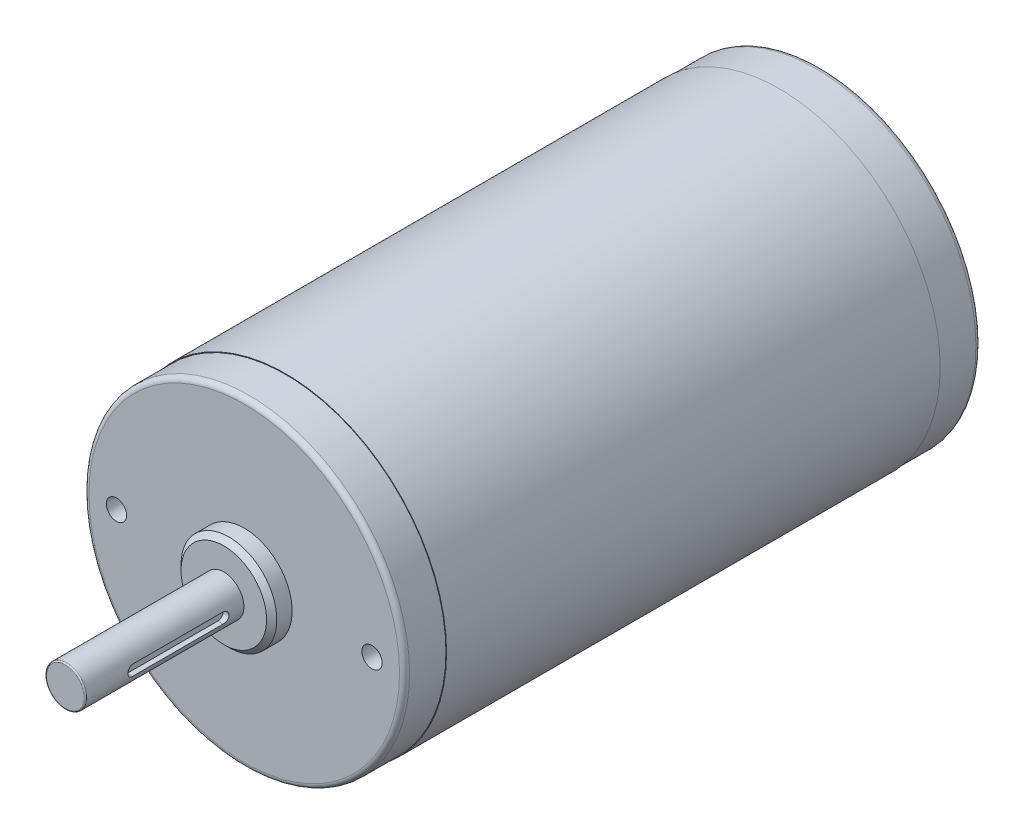
ISO-10303-21;
HEADER;
FILE_DESCRIPTION(('STEP AP214'),'2;1');
FILE_NAME('part.step','',(''),(''),'','','');
FILE_SCHEMA(('AUTOMOTIVE_DESIGN { 1 0 10303 214 1 1 1 1 }'));
ENDSEC;
DATA;
#1=APPLICATION_CONTEXT('core data for automotive mechanical design processes');
#2=APPLICATION_PROTOCOL_DEFINITION('international standard','automotive_design',2000,#1);
#3=PRODUCT_CONTEXT('',#1,'mechanical');
#4=PRODUCT('Part','Part','',(#3));
#5=PRODUCT_RELATED_PRODUCT_CATEGORY('part','',(#4));
#6=PRODUCT_DEFINITION_FORMATION('','',#4);
#7=PRODUCT_DEFINITION_CONTEXT('part definition',#1,'design');
#8=PRODUCT_DEFINITION('design','',#6,#7);
#9=PRODUCT_DEFINITION_SHAPE('','',#8);
#10=(LENGTH_UNIT() NAMED_UNIT(*) SI_UNIT(.MILLI.,.METRE.));
#11=(NAMED_UNIT(*) PLANE_ANGLE_UNIT() SI_UNIT($,.RADIAN.));
#12=(NAMED_UNIT(*) SI_UNIT($,.STERADIAN.) SOLID_ANGLE_UNIT());
#13=UNCERTAINTY_MEASURE_WITH_UNIT(LENGTH_MEASURE(1.E-05),#10,'distance_accuracy_value','');
#14=(GEOMETRIC_REPRESENTATION_CONTEXT(3) GLOBAL_UNCERTAINTY_ASSIGNED_CONTEXT((#13)) GLOBAL_UNIT_ASSIGNED_CONTEXT((#10,
#11,#12)) REPRESENTATION_CONTEXT('',''));
#15=CARTESIAN_POINT('',(0.,0.,0.));
#16=DIRECTION('',(0.,0.,1.));
#17=DIRECTION('',(1.,0.,0.));
#18=AXIS2_PLACEMENT_3D('',#15,#16,#17);
#19=CARTESIAN_POINT('',(35.56,109.2962,54.614));
#20=DIRECTION('',(0.,0.,1.));
#21=DIRECTION('',(1.,0.,0.));
#22=AXIS2_PLACEMENT_3D('',#19,#20,#21);
#23=PLANE('',#22);
#24=CARTESIAN_POINT('',(35.56,109.2962,54.614));
#25=DIRECTION('',(0.,0.,-1.));
#26=DIRECTION('',(-1.,0.,0.));
#27=AXIS2_PLACEMENT_3D('',#24,#25,#26);
#28=CIRCLE('',#27,3.74600000000008);
#29=CARTESIAN_POINT('',(31.8139999999999,109.2962,54.614));
#30=VERTEX_POINT('',#29);
#31=CARTESIAN_POINT('',(39.3060000000001,109.2962,54.614));
#32=VERTEX_POINT('',#31);
#33=EDGE_CURVE('E116',#30,#32,#28,.T.);
#34=ORIENTED_EDGE('',*,*,#33,.F.);
#35=CARTESIAN_POINT('',(35.56,109.2962,54.614));
#36=DIRECTION('',(0.,0.,-1.));
#37=DIRECTION('',(1.,0.,0.));
#38=AXIS2_PLACEMENT_3D('',#35,#36,#37);
#39=CIRCLE('',#38,3.74600000000008);
#40=EDGE_CURVE('E109',#32,#30,#39,.T.);
#41=ORIENTED_EDGE('',*,*,#40,.F.);
#42=EDGE_LOOP('',(#34,#41));
#43=FACE_BOUND('',#42,.T.);
#44=ADVANCED_FACE('F17',(#43),#23,.T.);
#45=CARTESIAN_POINT('',(38.3600000000001,109.2962,16.4984772078548));
#46=DIRECTION('',(1.,0.,0.));
#47=DIRECTION('',(0.,0.,-1.));
#48=AXIS2_PLACEMENT_3D('',#45,#46,#47);
#49=PLANE('',#48);
#50=DIRECTION('',(0.,0.,1.));
#51=VECTOR('',#50,1.);
#52=CARTESIAN_POINT('',(38.3600000000001,108.2462,16.4984772078548));
#53=LINE('',#52,#51);
#54=CARTESIAN_POINT('',(38.3600000000001,108.2462,27.1));
#55=VERTEX_POINT('',#54);
#56=CARTESIAN_POINT('',(38.3600000000001,108.2462,45.1));
#57=VERTEX_POINT('',#56);
#58=EDGE_CURVE('E104',#55,#57,#53,.T.);
#59=ORIENTED_EDGE('',*,*,#58,.F.);
#60=CARTESIAN_POINT('',(38.3600000000001,109.2962,27.1));
#61=DIRECTION('',(1.,0.,0.));
#62=DIRECTION('',(0.,0.,-1.));
#63=AXIS2_PLACEMENT_3D('',#60,#61,#62);
#64=CIRCLE('',#63,1.05);
#65=CARTESIAN_POINT('',(38.3600000000001,110.3462,27.1));
#66=VERTEX_POINT('',#65);
#67=EDGE_CURVE('E94',#55,#66,#64,.T.);
#68=ORIENTED_EDGE('',*,*,#67,.T.);
#69=DIRECTION('',(0.,0.,1.));
#70=VECTOR('',#69,1.);
#71=CARTESIAN_POINT('',(38.3600000000001,110.3462,16.4984772078548));
#72=LINE('',#71,#70);
#73=CARTESIAN_POINT('',(38.3600000000001,110.3462,45.1));
#74=VERTEX_POINT('',#73);
#75=EDGE_CURVE('E120',#66,#74,#72,.T.);
#76=ORIENTED_EDGE('',*,*,#75,.T.);
#77=CARTESIAN_POINT('',(38.3600000000001,109.2962,45.1));
#78=DIRECTION('',(-1.,0.,0.));
#79=DIRECTION('',(0.,0.,1.));
#80=AXIS2_PLACEMENT_3D('',#77,#78,#79);
#81=CIRCLE('',#80,1.05);
#82=EDGE_CURVE('E88',#74,#57,#81,.F.);
#83=ORIENTED_EDGE('',*,*,#82,.T.);
#84=EDGE_LOOP('',(#59,#68,#76,#83));
#85=FACE_BOUND('',#84,.T.);
#86=ADVANCED_FACE('F105',(#85),#49,.T.);
#87=CARTESIAN_POINT('',(38.3600000000001,108.2462,16.4984772078548));
#88=DIRECTION('',(0.,1.,0.));
#89=DIRECTION('',(0.,0.,1.));
#90=AXIS2_PLACEMENT_3D('',#87,#88,#89);
#91=PLANE('',#90);
#92=DIRECTION('',(0.,0.,-1.));
#93=VECTOR('',#92,1.);
#94=CARTESIAN_POINT('',(39.4197279696891,108.2462,54.614));
#95=LINE('',#94,#93);
#96=CARTESIAN_POINT('',(39.4197279696891,108.2462,27.1));
#97=VERTEX_POINT('',#96);
#98=CARTESIAN_POINT('',(39.4197279696891,108.2462,45.1));
#99=VERTEX_POINT('',#98);
#100=EDGE_CURVE('E113',#97,#99,#95,.F.);
#101=ORIENTED_EDGE('',*,*,#100,.F.);
#102=DIRECTION('',(1.,0.,0.));
#103=VECTOR('',#102,1.);
#104=CARTESIAN_POINT('',(38.3600000000001,108.2462,27.1));
#105=LINE('',#104,#103);
#106=EDGE_CURVE('E98',#97,#55,#105,.F.);
#107=ORIENTED_EDGE('',*,*,#106,.T.);
#108=ORIENTED_EDGE('',*,*,#58,.T.);
#109=DIRECTION('',(1.,0.,0.));
#110=VECTOR('',#109,1.);
#111=CARTESIAN_POINT('',(38.3600000000001,108.2462,45.1));
#112=LINE('',#111,#110);
#113=EDGE_CURVE('E114',#57,#99,#112,.T.);
#114=ORIENTED_EDGE('',*,*,#113,.T.);
#115=EDGE_LOOP('',(#101,#107,#108,#114));
#116=FACE_BOUND('',#115,.T.);
#117=ADVANCED_FACE('F111',(#116),#91,.T.);
#118=CARTESIAN_POINT('',(35.56,109.2962,54.36));
#119=DIRECTION('',(0.,0.,1.));
#120=DIRECTION('',(1.,0.,0.));
#121=AXIS2_PLACEMENT_3D('',#118,#119,#120);
#122=TOROIDAL_SURFACE('',#121,3.74600000000008,0.254);
#123=ORIENTED_EDGE('',*,*,#40,.T.);
#124=ORIENTED_EDGE('',*,*,#33,.T.);
#125=EDGE_LOOP('',(#123,#124));
#126=FACE_BOUND('',#125,.T.);
#127=CARTESIAN_POINT('',(35.56,109.2962,54.36));
#128=DIRECTION('',(0.,0.,-1.));
#129=DIRECTION('',(-1.,0.,0.));
#130=AXIS2_PLACEMENT_3D('',#127,#128,#129);
#131=CIRCLE('',#130,4.00000000000007);
#132=CARTESIAN_POINT('',(31.5599999999999,109.2962,54.36));
#133=VERTEX_POINT('',#132);
#134=EDGE_CURVE('E165',#133,#133,#131,.T.);
#135=ORIENTED_EDGE('',*,*,#134,.F.);
#136=EDGE_LOOP('',(#135));
#137=FACE_BOUND('',#136,.T.);
#138=ADVANCED_FACE('F147',(#126,#137),#122,.T.);
#139=CARTESIAN_POINT('',(38.3600000000001,109.2962,45.1));
#140=DIRECTION('',(-1.,0.,0.));
#141=DIRECTION('',(0.,0.,1.));
#142=AXIS2_PLACEMENT_3D('',#139,#140,#141);
#143=CYLINDRICAL_SURFACE('',#142,1.05);
#144=DIRECTION('',(1.,0.,0.));
#145=VECTOR('',#144,1.);
#146=CARTESIAN_POINT('',(38.3600000000001,110.3462,45.1));
#147=LINE('',#146,#145);
#148=CARTESIAN_POINT('',(39.4197279696891,110.3462,45.1));
#149=VERTEX_POINT('',#148);
#150=EDGE_CURVE('E102',#74,#149,#147,.T.);
#151=ORIENTED_EDGE('',*,*,#150,.T.);
#152=CARTESIAN_POINT('',(39.4197279696891,108.2462,45.1));
#153=CARTESIAN_POINT('',(39.4197258950768,108.24619958975,45.1289948990377));
#154=CARTESIAN_POINT('',(39.4200551064328,108.247401772744,45.1579753771942));
#155=CARTESIAN_POINT('',(39.4213547123988,108.252193790165,45.2157185717611));
#156=CARTESIAN_POINT('',(39.4223249908093,108.255783191888,45.2444813266804));
#157=CARTESIAN_POINT('',(39.4261578920524,108.270078067236,45.3300048839447));
#158=CARTESIAN_POINT('',(39.4299428342912,108.284310457697,45.3861763507014));
#159=CARTESIAN_POINT('',(39.4395286889104,108.321713164946,45.4952257963179));
#160=CARTESIAN_POINT('',(39.445329326456,108.344882263286,45.5481042230163));
#161=CARTESIAN_POINT('',(39.4582892232805,108.399469503916,45.6492511443793));
#162=CARTESIAN_POINT('',(39.4654488628844,108.430889956344,45.6975183428654));
#163=CARTESIAN_POINT('',(39.4805119710478,108.501890363002,45.7892077701155));
#164=CARTESIAN_POINT('',(39.4884281885094,108.541632256913,45.8325024671448));
#165=CARTESIAN_POINT('',(39.5040047400555,108.627813145963,45.9119068745175));
#166=CARTESIAN_POINT('',(39.5116649818293,108.67425452566,45.9480140156475));
#167=CARTESIAN_POINT('',(39.526010604883,108.773412379805,46.0125503896214));
#168=CARTESIAN_POINT('',(39.5326785635433,108.826216831296,46.040848518688));
#169=CARTESIAN_POINT('',(39.5441298010583,108.936002054238,46.0880888400132));
#170=CARTESIAN_POINT('',(39.5489153447307,108.992977708579,46.1070422822868));
#171=CARTESIAN_POINT('',(39.5549473168842,109.091228422711,46.1306241727345));
#172=CARTESIAN_POINT('',(39.5568321627736,109.13185376544,46.1378772746766));
#173=CARTESIAN_POINT('',(39.5593590428507,109.213713896391,46.147566034752));
#174=CARTESIAN_POINT('',(39.560001100914,109.254948672889,46.1500017854335));
#175=CARTESIAN_POINT('',(39.5599984549201,109.354094261643,46.1499974942296));
#176=CARTESIAN_POINT('',(39.5587300938834,109.412021122661,46.1451938276971));
#177=CARTESIAN_POINT('',(39.5537908073877,109.526225171743,46.1261319193829));
#178=CARTESIAN_POINT('',(39.5501176251492,109.582500758305,46.1118647965529));
#179=CARTESIAN_POINT('',(39.5407752151886,109.691711041936,46.0743710095572));
#180=CARTESIAN_POINT('',(39.5351088856793,109.744650458997,46.051157349786));
#181=CARTESIAN_POINT('',(39.5223803452478,109.845880148194,45.9964722913931));
#182=CARTESIAN_POINT('',(39.5153181479083,109.894170465564,45.9650009731229));
#183=CARTESIAN_POINT('',(39.5003832391547,109.985824414736,45.8939447079381));
#184=CARTESIAN_POINT('',(39.4924970081334,110.029068444468,45.8542083308329));
#185=CARTESIAN_POINT('',(39.4768899553604,110.108363690847,45.768070017791));
#186=CARTESIAN_POINT('',(39.4691691622905,110.144413669136,45.7216669366335));
#187=CARTESIAN_POINT('',(39.4546281048764,110.208880604601,45.6225587145474));
#188=CARTESIAN_POINT('',(39.447825217303,110.237158627992,45.5697605148942));
#189=CARTESIAN_POINT('',(39.4360941322255,110.284374941225,45.4599645484902));
#190=CARTESIAN_POINT('',(39.4311644713835,110.303320524877,45.4029701015121));
#191=CARTESIAN_POINT('',(39.424947536189,110.326869937927,45.3047298343336));
#192=CARTESIAN_POINT('',(39.4230031721686,110.334106552333,45.2641375466187));
#193=CARTESIAN_POINT('',(39.4203876966156,110.343775049367,45.1823710409093));
#194=CARTESIAN_POINT('',(39.419715789786,110.346209933161,45.141197202614));
#195=CARTESIAN_POINT('',(39.4197279696891,110.3462,45.1));
#196=B_SPLINE_CURVE_WITH_KNOTS('',3,(#152,#153,#154,#155,#156,#157,#158,#159,#160,#161,#162,
#163,#164,#165,#166,#167,#168,#169,#170,#171,#172,#173,#174,#175,#176,#177,#178,#179,#180,#181,
#182,#183,#184,#185,#186,#187,#188,#189,#190,#191,#192,#193,#194,#195),.UNSPECIFIED.,.F.,.F.,(4,
2,2,2,2,2,2,2,2,2,2,2,2,2,2,2,2,2,2,2,2,4),(0.,0.0869295778834422,0.17384340328612,
0.347151826879625,0.520436629596116,0.69376999881019,0.870856390838584,1.04800596970821,
1.22797015523126,1.40771715061754,1.53136439682193,1.65500926755904,1.82853892099362,
2.0022316554156,2.17567286221397,2.34911238140169,2.52606492372393,2.70304789975981,
2.88301467869373,3.0628405797152,3.18638852057382,3.3098592173462),.UNSPECIFIED.);
#197=EDGE_CURVE('E168',#99,#149,#196,.T.);
#198=ORIENTED_EDGE('',*,*,#197,.F.);
#199=ORIENTED_EDGE('',*,*,#113,.F.);
#200=ORIENTED_EDGE('',*,*,#82,.F.);
#201=EDGE_LOOP('',(#151,#198,#199,#200));
#202=FACE_BOUND('',#201,.T.);
#203=ADVANCED_FACE('F157',(#202),#143,.F.);
#204=CARTESIAN_POINT('',(38.3600000000001,110.3462,16.4984772078548));
#205=DIRECTION('',(0.,1.,0.));
#206=DIRECTION('',(0.,0.,1.));
#207=AXIS2_PLACEMENT_3D('',#204,#205,#206);
#208=PLANE('',#207);
#209=ORIENTED_EDGE('',*,*,#150,.F.);
#210=ORIENTED_EDGE('',*,*,#75,.F.);
#211=DIRECTION('',(1.,0.,0.));
#212=VECTOR('',#211,1.);
#213=CARTESIAN_POINT('',(38.3600000000001,110.3462,27.1));
#214=LINE('',#213,#212);
#215=CARTESIAN_POINT('',(39.4197279696891,110.3462,27.1));
#216=VERTEX_POINT('',#215);
#217=EDGE_CURVE('E100',#66,#216,#214,.T.);
#218=ORIENTED_EDGE('',*,*,#217,.T.);
#219=DIRECTION('',(0.,0.,-1.));
#220=VECTOR('',#219,1.);
#221=CARTESIAN_POINT('',(39.4197279696891,110.3462,54.614));
#222=LINE('',#221,#220);
#223=EDGE_CURVE('E170',#149,#216,#222,.T.);
#224=ORIENTED_EDGE('',*,*,#223,.F.);
#225=EDGE_LOOP('',(#209,#210,#218,#224));
#226=FACE_BOUND('',#225,.T.);
#227=ADVANCED_FACE('F416',(#226),#208,.F.);
#228=CARTESIAN_POINT('',(38.3600000000001,109.2962,27.1));
#229=DIRECTION('',(1.,0.,0.));
#230=DIRECTION('',(0.,0.,-1.));
#231=AXIS2_PLACEMENT_3D('',#228,#229,#230);
#232=CYLINDRICAL_SURFACE('',#231,1.05);
#233=ORIENTED_EDGE('',*,*,#67,.F.);
#234=ORIENTED_EDGE('',*,*,#106,.F.);
#235=CARTESIAN_POINT('',(39.4197279696891,110.3462,27.1));
#236=CARTESIAN_POINT('',(39.4197258950768,110.34620041025,27.0710051009623));
#237=CARTESIAN_POINT('',(39.4200551064329,110.344998227256,27.0420246228058));
#238=CARTESIAN_POINT('',(39.4213547123988,110.340206209835,26.9842814282389));
#239=CARTESIAN_POINT('',(39.4223249908093,110.336616808112,26.9555186733196));
#240=CARTESIAN_POINT('',(39.4261578920524,110.322321932764,26.8699951160553));
#241=CARTESIAN_POINT('',(39.4299428342912,110.308089542303,26.8138236492985));
#242=CARTESIAN_POINT('',(39.4395286889104,110.270686835054,26.7047742036821));
#243=CARTESIAN_POINT('',(39.445329326456,110.247517736714,26.6518957769836));
#244=CARTESIAN_POINT('',(39.4582892232805,110.192930496084,26.5507488556207));
#245=CARTESIAN_POINT('',(39.4654488628844,110.161510043656,26.5024816571346));
#246=CARTESIAN_POINT('',(39.4805119710478,110.090509636998,26.4107922298844));
#247=CARTESIAN_POINT('',(39.4884281885094,110.050767743087,26.3674975328551));
#248=CARTESIAN_POINT('',(39.5040047400555,109.964586854037,26.2880931254825));
#249=CARTESIAN_POINT('',(39.5116649818293,109.91814547434,26.2519859843525));
#250=CARTESIAN_POINT('',(39.526010604883,109.818987620195,26.1874496103786));
#251=CARTESIAN_POINT('',(39.5326785635433,109.766183168704,26.159151481312));
#252=CARTESIAN_POINT('',(39.5441298010583,109.656397945762,26.1119111599868));
#253=CARTESIAN_POINT('',(39.5489153447307,109.599422291421,26.0929577177131));
#254=CARTESIAN_POINT('',(39.5549473168842,109.501171577289,26.0693758272655));
#255=CARTESIAN_POINT('',(39.5568321627736,109.46054623456,26.0621227253234));
#256=CARTESIAN_POINT('',(39.5593590428507,109.378686103609,26.052433965248));
#257=CARTESIAN_POINT('',(39.560001100914,109.337451327111,26.0499982145665));
#258=CARTESIAN_POINT('',(39.5599984549201,109.238305738357,26.0500025057704));
#259=CARTESIAN_POINT('',(39.5587300938834,109.18037887734,26.0548061723029));
#260=CARTESIAN_POINT('',(39.5537908073877,109.066174828257,26.0738680806171));
#261=CARTESIAN_POINT('',(39.5501176251492,109.009899241695,26.0881352034471));
#262=CARTESIAN_POINT('',(39.5407752151886,108.900688958064,26.1256289904428));
#263=CARTESIAN_POINT('',(39.5351088856793,108.847749541003,26.148842650214));
#264=CARTESIAN_POINT('',(39.5223803452478,108.746519851806,26.2035277086069));
#265=CARTESIAN_POINT('',(39.5153181479083,108.698229534436,26.2349990268771));
#266=CARTESIAN_POINT('',(39.5003832391547,108.606575585264,26.3060552920619));
#267=CARTESIAN_POINT('',(39.4924970081334,108.563331555532,26.3457916691671));
#268=CARTESIAN_POINT('',(39.4768899553604,108.484036309153,26.431929982209));
#269=CARTESIAN_POINT('',(39.4691691622905,108.447986330864,26.4783330633665));
#270=CARTESIAN_POINT('',(39.4546281048764,108.383519395399,26.5774412854526));
#271=CARTESIAN_POINT('',(39.447825217303,108.355241372008,26.6302394851058));
#272=CARTESIAN_POINT('',(39.4360941322255,108.308025058775,26.7400354515098));
#273=CARTESIAN_POINT('',(39.4311644713835,108.289079475123,26.7970298984879));
#274=CARTESIAN_POINT('',(39.424947536189,108.265530062073,26.8952701656664));
#275=CARTESIAN_POINT('',(39.4230031721686,108.258293447667,26.9358624533813));
#276=CARTESIAN_POINT('',(39.4203876966156,108.248624950633,27.0176289590907));
#277=CARTESIAN_POINT('',(39.419715789786,108.246190066839,27.058802797386));
#278=CARTESIAN_POINT('',(39.4197279696891,108.2462,27.1));
#279=B_SPLINE_CURVE_WITH_KNOTS('',3,(#235,#236,#237,#238,#239,#240,#241,#242,#243,#244,#245,
#246,#247,#248,#249,#250,#251,#252,#253,#254,#255,#256,#257,#258,#259,#260,#261,#262,#263,#264,
#265,#266,#267,#268,#269,#270,#271,#272,#273,#274,#275,#276,#277,#278),.UNSPECIFIED.,.F.,.F.,(4,
2,2,2,2,2,2,2,2,2,2,2,2,2,2,2,2,2,2,2,2,4),(0.,0.0869295778834455,0.173843403286115,
0.347151826879623,0.520436629596136,0.693769998810197,0.870856390838592,1.0480059697082,
1.22797015523124,1.40771715061754,1.53136439682191,1.65500926755904,1.82853892099358,
2.00223165541559,2.17567286221396,2.34911238140168,2.52606492372391,2.7030478997598,
2.88301467869372,3.06284057971519,3.18638852057381,3.30985921734618),.UNSPECIFIED.);
#280=EDGE_CURVE('E173',#216,#97,#279,.T.);
#281=ORIENTED_EDGE('',*,*,#280,.F.);
#282=ORIENTED_EDGE('',*,*,#217,.F.);
#283=EDGE_LOOP('',(#233,#234,#281,#282));
#284=FACE_BOUND('',#283,.T.);
#285=ADVANCED_FACE('F95',(#284),#232,.F.);
#286=CARTESIAN_POINT('',(35.56,109.2962,54.614));
#287=DIRECTION('',(0.,0.,-1.));
#288=DIRECTION('',(-1.,0.,0.));
#289=AXIS2_PLACEMENT_3D('',#286,#287,#288);
#290=CYLINDRICAL_SURFACE('',#289,4.00000000000007);
#291=ORIENTED_EDGE('',*,*,#100,.T.);
#292=ORIENTED_EDGE('',*,*,#197,.T.);
#293=ORIENTED_EDGE('',*,*,#223,.T.);
#294=ORIENTED_EDGE('',*,*,#280,.T.);
#295=EDGE_LOOP('',(#291,#292,#293,#294));
#296=FACE_BOUND('',#295,.T.);
#297=CARTESIAN_POINT('',(35.56,109.2962,23.114));
#298=DIRECTION('',(0.,0.,-1.));
#299=DIRECTION('',(-1.,0.,0.));
#300=AXIS2_PLACEMENT_3D('',#297,#298,#299);
#301=CIRCLE('',#300,4.00000000000007);
#302=CARTESIAN_POINT('',(31.5599999999999,109.2962,23.114));
#303=VERTEX_POINT('',#302);
#304=EDGE_CURVE('E409',#303,#303,#301,.T.);
#305=ORIENTED_EDGE('',*,*,#304,.F.);
#306=EDGE_LOOP('',(#305));
#307=FACE_BOUND('',#306,.T.);
#308=ORIENTED_EDGE('',*,*,#134,.T.);
#309=EDGE_LOOP('',(#308));
#310=FACE_BOUND('',#309,.T.);
#311=ADVANCED_FACE('F256',(#296,#307,#310),#290,.T.);
#312=CARTESIAN_POINT('',(35.56,109.2962,23.114));
#313=DIRECTION('',(0.,0.,1.));
#314=DIRECTION('',(1.,0.,0.));
#315=AXIS2_PLACEMENT_3D('',#312,#313,#314);
#316=PLANE('',#315);
#317=ORIENTED_EDGE('',*,*,#304,.T.);
#318=EDGE_LOOP('',(#317));
#319=FACE_BOUND('',#318,.T.);
#320=CARTESIAN_POINT('',(35.56,109.2962,23.114));
#321=DIRECTION('',(0.,0.,-1.));
#322=DIRECTION('',(-1.,0.,0.));
#323=AXIS2_PLACEMENT_3D('',#320,#321,#322);
#324=CIRCLE('',#323,8.50900000182337);
#325=CARTESIAN_POINT('',(27.0509999981766,109.2962,23.114));
#326=VERTEX_POINT('',#325);
#327=EDGE_CURVE('E407',#326,#326,#324,.T.);
#328=ORIENTED_EDGE('',*,*,#327,.F.);
#329=EDGE_LOOP('',(#328));
#330=FACE_BOUND('',#329,.T.);
#331=ADVANCED_FACE('F252',(#319,#330),#316,.T.);
#332=CARTESIAN_POINT('',(48.8853596371201,127.903290682857,-97.8026999980236));
#333=DIRECTION('',(0.,0.,-1.));
#334=DIRECTION('',(-1.,0.,0.));
#335=AXIS2_PLACEMENT_3D('',#332,#333,#334);
#336=PLANE('',#335);
#337=CARTESIAN_POINT('',(46.76735963712,127.903290682857,-97.8026999979988));
#338=DIRECTION('',(0.,0.,1.));
#339=DIRECTION('',(0.,-1.,0.));
#340=AXIS2_PLACEMENT_3D('',#337,#338,#339);
#341=CIRCLE('',#340,2.11800000003411);
#342=CARTESIAN_POINT('',(46.76735963712,125.785290682823,-97.8026999979988));
#343=VERTEX_POINT('',#342);
#344=EDGE_CURVE('E404',#343,#343,#341,.T.);
#345=ORIENTED_EDGE('',*,*,#344,.F.);
#346=EDGE_LOOP('',(#345));
#347=FACE_BOUND('',#346,.T.);
#348=ADVANCED_FACE('F248',(#347),#336,.T.);
#349=CARTESIAN_POINT('',(56.2850906808811,120.503559639096,-97.8026999980238));
#350=DIRECTION('',(0.,0.,-1.));
#351=DIRECTION('',(-1.,0.,0.));
#352=AXIS2_PLACEMENT_3D('',#349,#350,#351);
#353=PLANE('',#352);
#354=CARTESIAN_POINT('',(54.1670906808811,120.503559639096,-97.8026999980557));
#355=DIRECTION('',(0.,0.,1.));
#356=DIRECTION('',(0.,-1.,0.));
#357=AXIS2_PLACEMENT_3D('',#354,#355,#356);
#358=CIRCLE('',#357,2.11799999994966);
#359=CARTESIAN_POINT('',(54.1670906808811,118.385559639146,-97.8026999980557));
#360=VERTEX_POINT('',#359);
#361=EDGE_CURVE('E400',#360,#360,#358,.T.);
#362=ORIENTED_EDGE('',*,*,#361,.F.);
#363=EDGE_LOOP('',(#362));
#364=FACE_BOUND('',#363,.T.);
#365=ADVANCED_FACE('F236',(#364),#353,.T.);
#366=CARTESIAN_POINT('',(35.56,109.2962,-100.317299999998));
#367=DIRECTION('',(0.,0.,-1.));
#368=DIRECTION('',(-1.,0.,0.));
#369=AXIS2_PLACEMENT_3D('',#366,#367,#368);
#370=PLANE('',#369);
#371=CARTESIAN_POINT('',(35.56,109.2962,-100.317299999998));
#372=DIRECTION('',(0.,0.,1.));
#373=DIRECTION('',(1.,0.,0.));
#374=AXIS2_PLACEMENT_3D('',#371,#372,#373);
#375=CIRCLE('',#374,14.0368000000003);
#376=CARTESIAN_POINT('',(49.5968000000003,109.2962,-100.317299999998));
#377=VERTEX_POINT('',#376);
#378=CARTESIAN_POINT('',(21.5231999999997,109.2962,-100.317299999998));
#379=VERTEX_POINT('',#378);
#380=EDGE_CURVE('E217',#377,#379,#375,.T.);
#381=ORIENTED_EDGE('',*,*,#380,.F.);
#382=CARTESIAN_POINT('',(35.56,109.2962,-100.317299999998));
#383=DIRECTION('',(0.,0.,1.));
#384=DIRECTION('',(-1.,0.,0.));
#385=AXIS2_PLACEMENT_3D('',#382,#383,#384);
#386=CIRCLE('',#385,14.0368000000003);
#387=EDGE_CURVE('E403',#379,#377,#386,.T.);
#388=ORIENTED_EDGE('',*,*,#387,.F.);
#389=EDGE_LOOP('',(#381,#388));
#390=FACE_BOUND('',#389,.T.);
#391=ADVANCED_FACE('F225',(#390),#370,.T.);
#392=CARTESIAN_POINT('',(10.1599999999994,109.2962,5.43560000011212));
#393=DIRECTION('',(0.,0.,1.));
#394=DIRECTION('',(1.,0.,0.));
#395=AXIS2_PLACEMENT_3D('',#392,#393,#394);
#396=CONICAL_SURFACE('',#395,2.01930000012817,1.02974425747654);
#397=CARTESIAN_POINT('',(10.1600000000133,109.2962,4.22228214875986));
#398=VERTEX_POINT('',#397);
#399=VERTEX_LOOP('',#398);
#400=FACE_BOUND('',#399,.T.);
#401=CARTESIAN_POINT('',(10.1599999999994,109.2962,5.4356000000007));
#402=DIRECTION('',(0.,0.,1.));
#403=DIRECTION('',(1.,0.,0.));
#404=AXIS2_PLACEMENT_3D('',#401,#402,#403);
#405=CIRCLE('',#404,2.01930000000003);
#406=CARTESIAN_POINT('',(12.1792999999994,109.2962,5.4356000000007));
#407=VERTEX_POINT('',#406);
#408=EDGE_CURVE('E214',#407,#407,#405,.T.);
#409=ORIENTED_EDGE('',*,*,#408,.T.);
#410=EDGE_LOOP('',(#409));
#411=FACE_BOUND('',#410,.T.);
#412=ADVANCED_FACE('F235',(#400,#411),#396,.F.);
#413=CARTESIAN_POINT('',(60.96,109.2962,5.43559999994159));
#414=DIRECTION('',(0.,0.,1.));
#415=DIRECTION('',(1.,0.,0.));
#416=AXIS2_PLACEMENT_3D('',#413,#414,#415);
#417=CONICAL_SURFACE('',#416,2.01929999988128,1.02974425744088);
#418=CARTESIAN_POINT('',(60.9599999998807,109.2962,4.22228214875986));
#419=VERTEX_POINT('',#418);
#420=VERTEX_LOOP('',#419);
#421=FACE_BOUND('',#420,.T.);
#422=CARTESIAN_POINT('',(60.96,109.2962,5.43560000000074));
#423=DIRECTION('',(0.,0.,1.));
#424=DIRECTION('',(1.,0.,0.));
#425=AXIS2_PLACEMENT_3D('',#422,#423,#424);
#426=CIRCLE('',#425,2.01930000000003);
#427=CARTESIAN_POINT('',(62.9793,109.2962,5.43560000000074));
#428=VERTEX_POINT('',#427);
#429=EDGE_CURVE('E211',#428,#428,#426,.T.);
#430=ORIENTED_EDGE('',*,*,#429,.T.);
#431=EDGE_LOOP('',(#430));
#432=FACE_BOUND('',#431,.T.);
#433=ADVANCED_FACE('F572',(#421,#432),#417,.F.);
#434=CARTESIAN_POINT('',(35.56,109.2962,22.0979999999996));
#435=DIRECTION('',(0.,0.,-1.));
#436=DIRECTION('',(-1.,0.,0.));
#437=AXIS2_PLACEMENT_3D('',#434,#435,#436);
#438=CONICAL_SURFACE('',#437,9.52500000000019,0.785398162500005);
#439=CARTESIAN_POINT('',(35.56,109.2962,22.0979999999996));
#440=DIRECTION('',(0.,0.,-1.));
#441=DIRECTION('',(-1.,0.,0.));
#442=AXIS2_PLACEMENT_3D('',#439,#440,#441);
#443=CIRCLE('',#442,9.52500000000019);
#444=CARTESIAN_POINT('',(26.0349999999998,109.2962,22.0979999999996));
#445=VERTEX_POINT('',#444);
#446=EDGE_CURVE('E208',#445,#445,#443,.T.);
#447=ORIENTED_EDGE('',*,*,#446,.F.);
#448=EDGE_LOOP('',(#447));
#449=FACE_BOUND('',#448,.T.);
#450=ORIENTED_EDGE('',*,*,#327,.T.);
#451=EDGE_LOOP('',(#450));
#452=FACE_BOUND('',#451,.T.);
#453=ADVANCED_FACE('F565',(#449,#452),#438,.T.);
#454=CARTESIAN_POINT('',(46.76735963712,127.903290682857,-95.6026999959931));
#455=DIRECTION('',(0.,0.,1.));
#456=DIRECTION('',(0.,-1.,0.));
#457=AXIS2_PLACEMENT_3D('',#454,#455,#456);
#458=CONICAL_SURFACE('',#457,4.31800000198298,0.785398163384529);
#459=CARTESIAN_POINT('',(46.76735963712,127.903290682857,-95.6026999960491));
#460=DIRECTION('',(0.,0.,1.));
#461=DIRECTION('',(1.,0.,0.));
#462=AXIS2_PLACEMENT_3D('',#459,#460,#461);
#463=CIRCLE('',#462,4.3180000019745);
#464=CARTESIAN_POINT('',(51.0853596390945,127.903290682857,-95.6026999960491));
#465=VERTEX_POINT('',#464);
#466=EDGE_CURVE('E205',#465,#465,#463,.T.);
#467=ORIENTED_EDGE('',*,*,#466,.F.);
#468=EDGE_LOOP('',(#467));
#469=FACE_BOUND('',#468,.T.);
#470=ORIENTED_EDGE('',*,*,#344,.T.);
#471=EDGE_LOOP('',(#470));
#472=FACE_BOUND('',#471,.T.);
#473=ADVANCED_FACE('F571',(#469,#472),#458,.T.);
#474=CARTESIAN_POINT('',(54.1670906808811,120.503559639096,-95.6026999961637));
#475=DIRECTION('',(0.,0.,1.));
#476=DIRECTION('',(0.,-1.,0.));
#477=AXIS2_PLACEMENT_3D('',#474,#475,#476);
#478=CONICAL_SURFACE('',#477,4.31800000184168,0.785398163397448);
#479=CARTESIAN_POINT('',(54.1670906808811,120.503559639096,-95.6026999960494));
#480=DIRECTION('',(0.,0.,1.));
#481=DIRECTION('',(1.,0.,0.));
#482=AXIS2_PLACEMENT_3D('',#479,#480,#481);
#483=CIRCLE('',#482,4.31800000197446);
#484=CARTESIAN_POINT('',(58.4850906828556,120.503559639096,-95.6026999960494));
#485=VERTEX_POINT('',#484);
#486=EDGE_CURVE('E202',#485,#485,#483,.T.);
#487=ORIENTED_EDGE('',*,*,#486,.F.);
#488=EDGE_LOOP('',(#487));
#489=FACE_BOUND('',#488,.T.);
#490=ORIENTED_EDGE('',*,*,#361,.T.);
#491=EDGE_LOOP('',(#490));
#492=FACE_BOUND('',#491,.T.);
#493=ADVANCED_FACE('F192',(#489,#492),#478,.T.);
#494=CARTESIAN_POINT('',(35.56,109.2962,-99.317299999998));
#495=DIRECTION('',(0.,0.,-1.));
#496=DIRECTION('',(-1.,0.,0.));
#497=AXIS2_PLACEMENT_3D('',#494,#495,#496);
#498=TOROIDAL_SURFACE('',#497,14.0368000000003,1.);
#499=ORIENTED_EDGE('',*,*,#387,.T.);
#500=ORIENTED_EDGE('',*,*,#380,.T.);
#501=EDGE_LOOP('',(#499,#500));
#502=FACE_BOUND('',#501,.T.);
#503=CARTESIAN_POINT('',(35.56,109.2962,-99.317299999998));
#504=DIRECTION('',(0.,0.,1.));
#505=DIRECTION('',(1.,0.,0.));
#506=AXIS2_PLACEMENT_3D('',#503,#504,#505);
#507=CIRCLE('',#506,15.0368000000003);
#508=CARTESIAN_POINT('',(50.5968000000003,109.2962,-99.317299999998));
#509=VERTEX_POINT('',#508);
#510=EDGE_CURVE('E200',#509,#509,#507,.T.);
#511=ORIENTED_EDGE('',*,*,#510,.F.);
#512=EDGE_LOOP('',(#511));
#513=FACE_BOUND('',#512,.T.);
#514=ADVANCED_FACE('F180',(#502,#513),#498,.T.);
#515=CARTESIAN_POINT('',(10.1599999999994,109.2962,19.05));
#516=DIRECTION('',(0.,0.,1.));
#517=DIRECTION('',(1.,0.,0.));
#518=AXIS2_PLACEMENT_3D('',#515,#516,#517);
#519=CYLINDRICAL_SURFACE('',#518,2.01930000000003);
#520=CARTESIAN_POINT('',(10.1599999999994,109.2962,19.05));
#521=DIRECTION('',(0.,0.,1.));
#522=DIRECTION('',(1.,0.,0.));
#523=AXIS2_PLACEMENT_3D('',#520,#521,#522);
#524=CIRCLE('',#523,2.01930000000003);
#525=CARTESIAN_POINT('',(12.1792999999994,109.2962,19.05));
#526=VERTEX_POINT('',#525);
#527=EDGE_CURVE('E397',#526,#526,#524,.F.);
#528=ORIENTED_EDGE('',*,*,#527,.F.);
#529=EDGE_LOOP('',(#528));
#530=FACE_BOUND('',#529,.T.);
#531=ORIENTED_EDGE('',*,*,#408,.F.);
#532=EDGE_LOOP('',(#531));
#533=FACE_BOUND('',#532,.T.);
#534=ADVANCED_FACE('F191',(#530,#533),#519,.F.);
#535=CARTESIAN_POINT('',(60.96,109.2962,19.05));
#536=DIRECTION('',(0.,0.,1.));
#537=DIRECTION('',(1.,0.,0.));
#538=AXIS2_PLACEMENT_3D('',#535,#536,#537);
#539=CYLINDRICAL_SURFACE('',#538,2.01930000000003);
#540=CARTESIAN_POINT('',(60.96,109.2962,19.05));
#541=DIRECTION('',(0.,0.,1.));
#542=DIRECTION('',(1.,0.,0.));
#543=AXIS2_PLACEMENT_3D('',#540,#541,#542);
#544=CIRCLE('',#543,2.01930000000003);
#545=CARTESIAN_POINT('',(62.9793,109.2962,19.05));
#546=VERTEX_POINT('',#545);
#547=EDGE_CURVE('E394',#546,#546,#544,.F.);
#548=ORIENTED_EDGE('',*,*,#547,.F.);
#549=EDGE_LOOP('',(#548));
#550=FACE_BOUND('',#549,.T.);
#551=ORIENTED_EDGE('',*,*,#429,.F.);
#552=EDGE_LOOP('',(#551));
#553=FACE_BOUND('',#552,.T.);
#554=ADVANCED_FACE('F594',(#550,#553),#539,.F.);
#555=CARTESIAN_POINT('',(35.56,109.2962,23.114));
#556=DIRECTION('',(0.,0.,-1.));
#557=DIRECTION('',(-1.,0.,0.));
#558=AXIS2_PLACEMENT_3D('',#555,#556,#557);
#559=CYLINDRICAL_SURFACE('',#558,9.52500000000019);
#560=CARTESIAN_POINT('',(35.56,109.2962,19.05));
#561=DIRECTION('',(0.,0.,-1.));
#562=DIRECTION('',(-1.,0.,0.));
#563=AXIS2_PLACEMENT_3D('',#560,#561,#562);
#564=CIRCLE('',#563,9.52500000000019);
#565=CARTESIAN_POINT('',(26.0349999999998,109.2962,19.05));
#566=VERTEX_POINT('',#565);
#567=EDGE_CURVE('E391',#566,#566,#564,.T.);
#568=ORIENTED_EDGE('',*,*,#567,.F.);
#569=EDGE_LOOP('',(#568));
#570=FACE_BOUND('',#569,.T.);
#571=ORIENTED_EDGE('',*,*,#446,.T.);
#572=EDGE_LOOP('',(#571));
#573=FACE_BOUND('',#572,.T.);
#574=ADVANCED_FACE('F604',(#570,#573),#559,.T.);
#575=CARTESIAN_POINT('',(46.76735963712,127.903290682857,-97.8026999980236));
#576=DIRECTION('',(0.,0.,1.));
#577=DIRECTION('',(1.,0.,0.));
#578=AXIS2_PLACEMENT_3D('',#575,#576,#577);
#579=CYLINDRICAL_SURFACE('',#578,4.3180000019745);
#580=CARTESIAN_POINT('',(46.76735963712,127.903290682857,-95.554799999998));
#581=DIRECTION('',(0.,0.,1.));
#582=DIRECTION('',(1.,0.,0.));
#583=AXIS2_PLACEMENT_3D('',#580,#581,#582);
#584=CIRCLE('',#583,4.3180000019745);
#585=CARTESIAN_POINT('',(51.0853596390945,127.903290682857,-95.554799999998));
#586=VERTEX_POINT('',#585);
#587=EDGE_CURVE('E383',#586,#586,#584,.T.);
#588=ORIENTED_EDGE('',*,*,#587,.F.);
#589=EDGE_LOOP('',(#588));
#590=FACE_BOUND('',#589,.T.);
#591=ORIENTED_EDGE('',*,*,#466,.T.);
#592=EDGE_LOOP('',(#591));
#593=FACE_BOUND('',#592,.T.);
#594=ADVANCED_FACE('F614',(#590,#593),#579,.T.);
#595=CARTESIAN_POINT('',(54.1670906808811,120.503559639096,-97.8026999980238));
#596=DIRECTION('',(0.,0.,1.));
#597=DIRECTION('',(1.,0.,0.));
#598=AXIS2_PLACEMENT_3D('',#595,#596,#597);
#599=CYLINDRICAL_SURFACE('',#598,4.31800000197446);
#600=CARTESIAN_POINT('',(54.1670906808811,120.503559639096,-95.554799999998));
#601=DIRECTION('',(0.,0.,1.));
#602=DIRECTION('',(1.,0.,0.));
#603=AXIS2_PLACEMENT_3D('',#600,#601,#602);
#604=CIRCLE('',#603,4.31800000197446);
#605=CARTESIAN_POINT('',(58.4850906828556,120.503559639096,-95.554799999998));
#606=VERTEX_POINT('',#605);
#607=EDGE_CURVE('E379',#606,#606,#604,.T.);
#608=ORIENTED_EDGE('',*,*,#607,.F.);
#609=EDGE_LOOP('',(#608));
#610=FACE_BOUND('',#609,.T.);
#611=ORIENTED_EDGE('',*,*,#486,.T.);
#612=EDGE_LOOP('',(#611));
#613=FACE_BOUND('',#612,.T.);
#614=ADVANCED_FACE('F628',(#610,#613),#599,.T.);
#615=CARTESIAN_POINT('',(35.56,109.2962,-100.317299999998));
#616=DIRECTION('',(0.,0.,1.));
#617=DIRECTION('',(1.,0.,0.));
#618=AXIS2_PLACEMENT_3D('',#615,#616,#617);
#619=CYLINDRICAL_SURFACE('',#618,15.0368000000003);
#620=CARTESIAN_POINT('',(35.56,109.2962,-95.554799999998));
#621=DIRECTION('',(0.,0.,1.));
#622=DIRECTION('',(1.,0.,0.));
#623=AXIS2_PLACEMENT_3D('',#620,#621,#622);
#624=CIRCLE('',#623,15.0368000000003);
#625=CARTESIAN_POINT('',(50.5968000000003,109.2962,-95.554799999998));
#626=VERTEX_POINT('',#625);
#627=EDGE_CURVE('E377',#626,#626,#624,.T.);
#628=ORIENTED_EDGE('',*,*,#627,.F.);
#629=EDGE_LOOP('',(#628));
#630=FACE_BOUND('',#629,.T.);
#631=ORIENTED_EDGE('',*,*,#510,.T.);
#632=EDGE_LOOP('',(#631));
#633=FACE_BOUND('',#632,.T.);
#634=ADVANCED_FACE('F622',(#630,#633),#619,.T.);
#635=CARTESIAN_POINT('',(35.56,109.2962,19.05));
#636=DIRECTION('',(0.,0.,1.));
#637=DIRECTION('',(1.,0.,0.));
#638=AXIS2_PLACEMENT_3D('',#635,#636,#637);
#639=PLANE('',#638);
#640=ORIENTED_EDGE('',*,*,#567,.T.);
#641=EDGE_LOOP('',(#640));
#642=FACE_BOUND('',#641,.T.);
#643=ORIENTED_EDGE('',*,*,#547,.T.);
#644=EDGE_LOOP('',(#643));
#645=FACE_BOUND('',#644,.T.);
#646=ORIENTED_EDGE('',*,*,#527,.T.);
#647=EDGE_LOOP('',(#646));
#648=FACE_BOUND('',#647,.T.);
#649=CARTESIAN_POINT('',(35.56,109.2962,19.05));
#650=DIRECTION('',(0.,0.,-1.));
#651=DIRECTION('',(-1.,0.,0.));
#652=AXIS2_PLACEMENT_3D('',#649,#650,#651);
#653=CIRCLE('',#652,30.8770000000005);
#654=CARTESIAN_POINT('',(4.6829999999995,109.2962,19.05));
#655=VERTEX_POINT('',#654);
#656=CARTESIAN_POINT('',(66.4370000000005,109.2962,19.05));
#657=VERTEX_POINT('',#656);
#658=EDGE_CURVE('E349',#655,#657,#653,.T.);
#659=ORIENTED_EDGE('',*,*,#658,.F.);
#660=CARTESIAN_POINT('',(35.56,109.2962,19.05));
#661=DIRECTION('',(0.,0.,-1.));
#662=DIRECTION('',(1.,0.,0.));
#663=AXIS2_PLACEMENT_3D('',#660,#661,#662);
#664=CIRCLE('',#663,30.8770000000005);
#665=EDGE_CURVE('E359',#657,#655,#664,.T.);
#666=ORIENTED_EDGE('',*,*,#665,.F.);
#667=EDGE_LOOP('',(#659,#666));
#668=FACE_BOUND('',#667,.T.);
#669=ADVANCED_FACE('F324',(#642,#645,#648,#668),#639,.T.);
#670=CARTESIAN_POINT('',(35.56,109.2962,-95.554799999998));
#671=DIRECTION('',(0.,0.,-1.));
#672=DIRECTION('',(-1.,0.,0.));
#673=AXIS2_PLACEMENT_3D('',#670,#671,#672);
#674=PLANE('',#673);
#675=ORIENTED_EDGE('',*,*,#627,.T.);
#676=EDGE_LOOP('',(#675));
#677=FACE_BOUND('',#676,.T.);
#678=ORIENTED_EDGE('',*,*,#607,.T.);
#679=EDGE_LOOP('',(#678));
#680=FACE_BOUND('',#679,.T.);
#681=ORIENTED_EDGE('',*,*,#587,.T.);
#682=EDGE_LOOP('',(#681));
#683=FACE_BOUND('',#682,.T.);
#684=CARTESIAN_POINT('',(35.56,109.2962,-95.554799999998));
#685=DIRECTION('',(0.,0.,1.));
#686=DIRECTION('',(1.,0.,0.));
#687=AXIS2_PLACEMENT_3D('',#684,#685,#686);
#688=CIRCLE('',#687,30.8770000000005);
#689=CARTESIAN_POINT('',(66.4370000000005,109.2962,-95.554799999998));
#690=VERTEX_POINT('',#689);
#691=CARTESIAN_POINT('',(4.6829999999995,109.2962,-95.554799999998));
#692=VERTEX_POINT('',#691);
#693=EDGE_CURVE('E308',#690,#692,#688,.T.);
#694=ORIENTED_EDGE('',*,*,#693,.F.);
#695=CARTESIAN_POINT('',(35.56,109.2962,-95.554799999998));
#696=DIRECTION('',(0.,0.,1.));
#697=DIRECTION('',(-1.,0.,0.));
#698=AXIS2_PLACEMENT_3D('',#695,#696,#697);
#699=CIRCLE('',#698,30.8770000000005);
#700=EDGE_CURVE('E37',#692,#690,#699,.T.);
#701=ORIENTED_EDGE('',*,*,#700,.F.);
#702=EDGE_LOOP('',(#694,#701));
#703=FACE_BOUND('',#702,.T.);
#704=ADVANCED_FACE('F315',(#677,#680,#683,#703),#674,.T.);
#705=CARTESIAN_POINT('',(35.56,109.2962,18.05));
#706=DIRECTION('',(0.,0.,1.));
#707=DIRECTION('',(1.,0.,0.));
#708=AXIS2_PLACEMENT_3D('',#705,#706,#707);
#709=TOROIDAL_SURFACE('',#708,30.8770000000005,1.);
#710=ORIENTED_EDGE('',*,*,#665,.T.);
#711=ORIENTED_EDGE('',*,*,#658,.T.);
#712=EDGE_LOOP('',(#710,#711));
#713=FACE_BOUND('',#712,.T.);
#714=CARTESIAN_POINT('',(35.56,109.2962,18.05));
#715=DIRECTION('',(0.,0.,-1.));
#716=DIRECTION('',(-1.,0.,0.));
#717=AXIS2_PLACEMENT_3D('',#714,#715,#716);
#718=CIRCLE('',#717,31.8770000000005);
#719=CARTESIAN_POINT('',(3.6829999999995,109.2962,18.05));
#720=VERTEX_POINT('',#719);
#721=EDGE_CURVE('E306',#720,#720,#718,.T.);
#722=ORIENTED_EDGE('',*,*,#721,.F.);
#723=EDGE_LOOP('',(#722));
#724=FACE_BOUND('',#723,.T.);
#725=ADVANCED_FACE('F295',(#713,#724),#709,.T.);
#726=CARTESIAN_POINT('',(35.56,109.2962,-94.554799999998));
#727=DIRECTION('',(0.,0.,-1.));
#728=DIRECTION('',(-1.,0.,0.));
#729=AXIS2_PLACEMENT_3D('',#726,#727,#728);
#730=TOROIDAL_SURFACE('',#729,30.8770000000005,1.);
#731=ORIENTED_EDGE('',*,*,#700,.T.);
#732=ORIENTED_EDGE('',*,*,#693,.T.);
#733=EDGE_LOOP('',(#731,#732));
#734=FACE_BOUND('',#733,.T.);
#735=CARTESIAN_POINT('',(35.56,109.2962,-94.554799999998));
#736=DIRECTION('',(0.,0.,1.));
#737=DIRECTION('',(1.,0.,0.));
#738=AXIS2_PLACEMENT_3D('',#735,#736,#737);
#739=CIRCLE('',#738,31.8770000000005);
#740=CARTESIAN_POINT('',(67.4370000000005,109.2962,-94.554799999998));
#741=VERTEX_POINT('',#740);
#742=EDGE_CURVE('E305',#741,#741,#739,.T.);
#743=ORIENTED_EDGE('',*,*,#742,.F.);
#744=EDGE_LOOP('',(#743));
#745=FACE_BOUND('',#744,.T.);
#746=ADVANCED_FACE('F283',(#734,#745),#730,.T.);
#747=CARTESIAN_POINT('',(35.56,109.2962,19.05));
#748=DIRECTION('',(0.,0.,-1.));
#749=DIRECTION('',(-1.,0.,0.));
#750=AXIS2_PLACEMENT_3D('',#747,#748,#749);
#751=CYLINDRICAL_SURFACE('',#750,31.8770000000005);
#752=CARTESIAN_POINT('',(35.56,109.2962,10.8204000000007));
#753=DIRECTION('',(0.,0.,-1.));
#754=DIRECTION('',(-1.,0.,0.));
#755=AXIS2_PLACEMENT_3D('',#752,#753,#754);
#756=CIRCLE('',#755,31.8770000000005);
#757=CARTESIAN_POINT('',(3.6829999999995,109.2962,10.8204000000007));
#758=VERTEX_POINT('',#757);
#759=EDGE_CURVE('E386',#758,#758,#756,.T.);
#760=ORIENTED_EDGE('',*,*,#759,.F.);
#761=EDGE_LOOP('',(#760));
#762=FACE_BOUND('',#761,.T.);
#763=ORIENTED_EDGE('',*,*,#721,.T.);
#764=EDGE_LOOP('',(#763));
#765=FACE_BOUND('',#764,.T.);
#766=ADVANCED_FACE('F294',(#762,#765),#751,.T.);
#767=CARTESIAN_POINT('',(35.56,109.2962,-95.554799999998));
#768=DIRECTION('',(0.,0.,1.));
#769=DIRECTION('',(1.,0.,0.));
#770=AXIS2_PLACEMENT_3D('',#767,#768,#769);
#771=CYLINDRICAL_SURFACE('',#770,31.8770000000005);
#772=CARTESIAN_POINT('',(35.56,109.2962,-87.325199999998));
#773=DIRECTION('',(0.,0.,1.));
#774=DIRECTION('',(1.,0.,0.));
#775=AXIS2_PLACEMENT_3D('',#772,#773,#774);
#776=CIRCLE('',#775,31.8770000000005);
#777=CARTESIAN_POINT('',(67.4370000000005,109.2962,-87.325199999998));
#778=VERTEX_POINT('',#777);
#779=EDGE_CURVE('E448',#778,#778,#776,.T.);
#780=ORIENTED_EDGE('',*,*,#779,.F.);
#781=EDGE_LOOP('',(#780));
#782=FACE_BOUND('',#781,.T.);
#783=ORIENTED_EDGE('',*,*,#742,.T.);
#784=EDGE_LOOP('',(#783));
#785=FACE_BOUND('',#784,.T.);
#786=ADVANCED_FACE('F437',(#782,#785),#771,.T.);
#787=CARTESIAN_POINT('',(67.5640000000005,109.2962,10.8204000000007));
#788=DIRECTION('',(0.,0.,1.));
#789=DIRECTION('',(1.,0.,0.));
#790=AXIS2_PLACEMENT_3D('',#787,#788,#789);
#791=PLANE('',#790);
#792=ORIENTED_EDGE('',*,*,#759,.T.);
#793=EDGE_LOOP('',(#792));
#794=FACE_BOUND('',#793,.T.);
#795=CARTESIAN_POINT('',(35.56,109.2962,10.8204000000007));
#796=DIRECTION('',(0.,0.,-1.));
#797=DIRECTION('',(-1.,0.,0.));
#798=AXIS2_PLACEMENT_3D('',#795,#796,#797);
#799=CIRCLE('',#798,32.0040000000005);
#800=CARTESIAN_POINT('',(3.5559999999995,109.2962,10.8204000000007));
#801=VERTEX_POINT('',#800);
#802=EDGE_CURVE('E29',#801,#801,#799,.T.);
#803=ORIENTED_EDGE('',*,*,#802,.F.);
#804=EDGE_LOOP('',(#803));
#805=FACE_BOUND('',#804,.T.);
#806=ADVANCED_FACE('F431',(#794,#805),#791,.T.);
#807=CARTESIAN_POINT('',(35.56,109.2962,-87.325199999998));
#808=DIRECTION('',(0.,0.,-1.));
#809=DIRECTION('',(-1.,0.,0.));
#810=AXIS2_PLACEMENT_3D('',#807,#808,#809);
#811=PLANE('',#810);
#812=ORIENTED_EDGE('',*,*,#779,.T.);
#813=EDGE_LOOP('',(#812));
#814=FACE_BOUND('',#813,.T.);
#815=CARTESIAN_POINT('',(35.56,109.2962,-87.325199999998));
#816=DIRECTION('',(0.,0.,-1.));
#817=DIRECTION('',(-1.,0.,0.));
#818=AXIS2_PLACEMENT_3D('',#815,#816,#817);
#819=CIRCLE('',#818,32.0040000000005);
#820=CARTESIAN_POINT('',(3.5559999999995,109.2962,-87.325199999998));
#821=VERTEX_POINT('',#820);
#822=EDGE_CURVE('E10',#821,#821,#819,.F.);
#823=ORIENTED_EDGE('',*,*,#822,.F.);
#824=EDGE_LOOP('',(#823));
#825=FACE_BOUND('',#824,.T.);
#826=ADVANCED_FACE('F425',(#814,#825),#811,.T.);
#827=CARTESIAN_POINT('',(35.56,109.2962,10.8204000000007));
#828=DIRECTION('',(0.,0.,-1.));
#829=DIRECTION('',(-1.,0.,0.));
#830=AXIS2_PLACEMENT_3D('',#827,#828,#829);
#831=CYLINDRICAL_SURFACE('',#830,32.0040000000005);
#832=ORIENTED_EDGE('',*,*,#822,.T.);
#833=EDGE_LOOP('',(#832));
#834=FACE_BOUND('',#833,.T.);
#835=ORIENTED_EDGE('',*,*,#802,.T.);
#836=EDGE_LOOP('',(#835));
#837=FACE_BOUND('',#836,.T.);
#838=ADVANCED_FACE('F423',(#834,#837),#831,.T.);
#839=CLOSED_SHELL('',(#44,#86,#117,#138,#203,#227,#285,#311,#331,#348,#365,#391,#412,#433,#453,
#473,#493,#514,#534,#554,#574,#594,#614,#634,#669,#704,#725,#746,#766,#786,#806,#826,#838));
#840=MANIFOLD_SOLID_BREP('B1',#839);
#841=ADVANCED_BREP_SHAPE_REPRESENTATION('',(#18,#840),#14);
#842=SHAPE_DEFINITION_REPRESENTATION(#9,#841);
ENDSEC;
END-ISO-10303-21;
